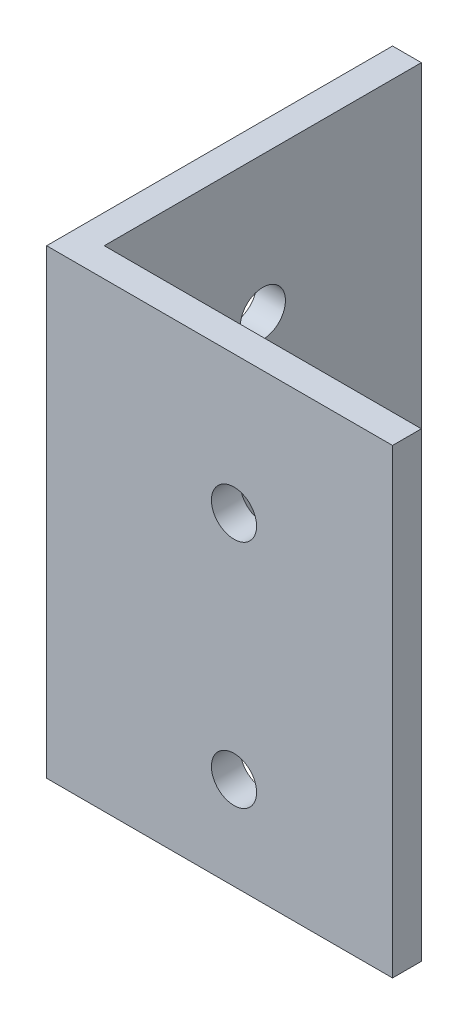
ISO-10303-21;
HEADER;
FILE_DESCRIPTION(('STEP AP214'),'2;1');
FILE_NAME('part.step','',(''),(''),'','','');
FILE_SCHEMA(('AUTOMOTIVE_DESIGN { 1 0 10303 214 1 1 1 1 }'));
ENDSEC;
DATA;
#1=APPLICATION_CONTEXT('core data for automotive mechanical design processes');
#2=APPLICATION_PROTOCOL_DEFINITION('international standard','automotive_design',2000,#1);
#3=PRODUCT_CONTEXT('',#1,'mechanical');
#4=PRODUCT('Part','Part','',(#3));
#5=PRODUCT_RELATED_PRODUCT_CATEGORY('part','',(#4));
#6=PRODUCT_DEFINITION_FORMATION('','',#4);
#7=PRODUCT_DEFINITION_CONTEXT('part definition',#1,'design');
#8=PRODUCT_DEFINITION('design','',#6,#7);
#9=PRODUCT_DEFINITION_SHAPE('','',#8);
#10=(LENGTH_UNIT() NAMED_UNIT(*) SI_UNIT(.MILLI.,.METRE.));
#11=(NAMED_UNIT(*) PLANE_ANGLE_UNIT() SI_UNIT($,.RADIAN.));
#12=(NAMED_UNIT(*) SI_UNIT($,.STERADIAN.) SOLID_ANGLE_UNIT());
#13=UNCERTAINTY_MEASURE_WITH_UNIT(LENGTH_MEASURE(1.E-05),#10,'distance_accuracy_value','');
#14=(GEOMETRIC_REPRESENTATION_CONTEXT(3) GLOBAL_UNCERTAINTY_ASSIGNED_CONTEXT((#13)) GLOBAL_UNIT_ASSIGNED_CONTEXT((#10,
#11,#12)) REPRESENTATION_CONTEXT('',''));
#15=CARTESIAN_POINT('',(0.,0.,0.));
#16=DIRECTION('',(0.,0.,1.));
#17=DIRECTION('',(1.,0.,0.));
#18=AXIS2_PLACEMENT_3D('',#15,#16,#17);
#19=CARTESIAN_POINT('',(0.,25.4,0.));
#20=DIRECTION('',(0.,0.,-1.));
#21=DIRECTION('',(-1.,0.,0.));
#22=AXIS2_PLACEMENT_3D('',#19,#20,#21);
#23=PLANE('',#22);
#24=CARTESIAN_POINT('',(20.6375,10.2108,0.));
#25=DIRECTION('',(0.,0.,-1.));
#26=DIRECTION('',(-1.,0.,0.));
#27=AXIS2_PLACEMENT_3D('',#24,#25,#26);
#28=CIRCLE('',#27,2.4892);
#29=CARTESIAN_POINT('',(18.1483,10.2108,0.));
#30=VERTEX_POINT('',#29);
#31=EDGE_CURVE('E119',#30,#30,#28,.T.);
#32=ORIENTED_EDGE('',*,*,#31,.T.);
#33=EDGE_LOOP('',(#32));
#34=FACE_BOUND('',#33,.T.);
#35=CARTESIAN_POINT('',(20.6375,-15.1892,0.));
#36=DIRECTION('',(0.,0.,-1.));
#37=DIRECTION('',(-1.,0.,0.));
#38=AXIS2_PLACEMENT_3D('',#35,#36,#37);
#39=CIRCLE('',#38,2.4892);
#40=CARTESIAN_POINT('',(18.1483,-15.1892,0.));
#41=VERTEX_POINT('',#40);
#42=EDGE_CURVE('E165',#41,#41,#39,.T.);
#43=ORIENTED_EDGE('',*,*,#42,.T.);
#44=EDGE_LOOP('',(#43));
#45=FACE_BOUND('',#44,.T.);
#46=DIRECTION('',(1.,0.,0.));
#47=VECTOR('',#46,1.);
#48=CARTESIAN_POINT('',(0.,-25.4,0.));
#49=LINE('',#48,#47);
#50=CARTESIAN_POINT('',(0.,-25.4,0.));
#51=VERTEX_POINT('',#50);
#52=CARTESIAN_POINT('',(38.1,-25.4,0.));
#53=VERTEX_POINT('',#52);
#54=EDGE_CURVE('E115',#51,#53,#49,.T.);
#55=ORIENTED_EDGE('',*,*,#54,.T.);
#56=DIRECTION('',(0.,-1.,0.));
#57=VECTOR('',#56,1.);
#58=CARTESIAN_POINT('',(38.1,25.4,0.));
#59=LINE('',#58,#57);
#60=CARTESIAN_POINT('',(38.1,25.4,0.));
#61=VERTEX_POINT('',#60);
#62=EDGE_CURVE('E11',#61,#53,#59,.T.);
#63=ORIENTED_EDGE('',*,*,#62,.F.);
#64=DIRECTION('',(1.,0.,0.));
#65=VECTOR('',#64,1.);
#66=CARTESIAN_POINT('',(0.,25.4,0.));
#67=LINE('',#66,#65);
#68=CARTESIAN_POINT('',(0.,25.4,0.));
#69=VERTEX_POINT('',#68);
#70=EDGE_CURVE('E80',#69,#61,#67,.T.);
#71=ORIENTED_EDGE('',*,*,#70,.F.);
#72=DIRECTION('',(0.,-1.,0.));
#73=VECTOR('',#72,1.);
#74=CARTESIAN_POINT('',(0.,25.4,0.));
#75=LINE('',#74,#73);
#76=EDGE_CURVE('E111',#69,#51,#75,.T.);
#77=ORIENTED_EDGE('',*,*,#76,.T.);
#78=EDGE_LOOP('',(#55,#63,#71,#77));
#79=FACE_BOUND('',#78,.T.);
#80=ADVANCED_FACE('F34',(#34,#45,#79),#23,.F.);
#81=CARTESIAN_POINT('',(38.1,25.4,-3.175));
#82=DIRECTION('',(1.,0.,0.));
#83=DIRECTION('',(0.,0.,-1.));
#84=AXIS2_PLACEMENT_3D('',#81,#82,#83);
#85=PLANE('',#84);
#86=DIRECTION('',(0.,0.,1.));
#87=VECTOR('',#86,1.);
#88=CARTESIAN_POINT('',(38.1,-25.4,-3.175));
#89=LINE('',#88,#87);
#90=CARTESIAN_POINT('',(38.1,-25.4,-3.175));
#91=VERTEX_POINT('',#90);
#92=EDGE_CURVE('E118',#91,#53,#89,.T.);
#93=ORIENTED_EDGE('',*,*,#92,.F.);
#94=DIRECTION('',(0.,-1.,0.));
#95=VECTOR('',#94,1.);
#96=CARTESIAN_POINT('',(38.1,25.4,-3.175));
#97=LINE('',#96,#95);
#98=CARTESIAN_POINT('',(38.1,25.4,-3.175));
#99=VERTEX_POINT('',#98);
#100=EDGE_CURVE('E42',#99,#91,#97,.T.);
#101=ORIENTED_EDGE('',*,*,#100,.F.);
#102=DIRECTION('',(0.,0.,1.));
#103=VECTOR('',#102,1.);
#104=CARTESIAN_POINT('',(38.1,25.4,-3.175));
#105=LINE('',#104,#103);
#106=EDGE_CURVE('E178',#99,#61,#105,.T.);
#107=ORIENTED_EDGE('',*,*,#106,.T.);
#108=ORIENTED_EDGE('',*,*,#62,.T.);
#109=EDGE_LOOP('',(#93,#101,#107,#108));
#110=FACE_BOUND('',#109,.T.);
#111=ADVANCED_FACE('F137',(#110),#85,.T.);
#112=CARTESIAN_POINT('',(0.,25.4,-3.175));
#113=DIRECTION('',(0.,0.,-1.));
#114=DIRECTION('',(-1.,0.,0.));
#115=AXIS2_PLACEMENT_3D('',#112,#113,#114);
#116=PLANE('',#115);
#117=CARTESIAN_POINT('',(20.6375,10.2108,-3.175));
#118=DIRECTION('',(0.,0.,-1.));
#119=DIRECTION('',(-1.,0.,0.));
#120=AXIS2_PLACEMENT_3D('',#117,#118,#119);
#121=CIRCLE('',#120,2.4892);
#122=CARTESIAN_POINT('',(18.1483,10.2108,-3.175));
#123=VERTEX_POINT('',#122);
#124=EDGE_CURVE('E167',#123,#123,#121,.T.);
#125=ORIENTED_EDGE('',*,*,#124,.F.);
#126=EDGE_LOOP('',(#125));
#127=FACE_BOUND('',#126,.T.);
#128=CARTESIAN_POINT('',(20.6375,-15.1892,-3.175));
#129=DIRECTION('',(0.,0.,-1.));
#130=DIRECTION('',(-1.,0.,0.));
#131=AXIS2_PLACEMENT_3D('',#128,#129,#130);
#132=CIRCLE('',#131,2.4892);
#133=CARTESIAN_POINT('',(18.1483,-15.1892,-3.175));
#134=VERTEX_POINT('',#133);
#135=EDGE_CURVE('E168',#134,#134,#132,.T.);
#136=ORIENTED_EDGE('',*,*,#135,.F.);
#137=EDGE_LOOP('',(#136));
#138=FACE_BOUND('',#137,.T.);
#139=DIRECTION('',(1.,0.,0.));
#140=VECTOR('',#139,1.);
#141=CARTESIAN_POINT('',(0.,-25.4,-3.175));
#142=LINE('',#141,#140);
#143=CARTESIAN_POINT('',(3.175,-25.4,-3.175));
#144=VERTEX_POINT('',#143);
#145=EDGE_CURVE('E122',#144,#91,#142,.T.);
#146=ORIENTED_EDGE('',*,*,#145,.F.);
#147=DIRECTION('',(0.,-1.,0.));
#148=VECTOR('',#147,1.);
#149=CARTESIAN_POINT('',(3.175,25.4,-3.175));
#150=LINE('',#149,#148);
#151=CARTESIAN_POINT('',(3.175,25.4,-3.175));
#152=VERTEX_POINT('',#151);
#153=EDGE_CURVE('E101',#152,#144,#150,.T.);
#154=ORIENTED_EDGE('',*,*,#153,.F.);
#155=DIRECTION('',(1.,0.,0.));
#156=VECTOR('',#155,1.);
#157=CARTESIAN_POINT('',(0.,25.4,-3.175));
#158=LINE('',#157,#156);
#159=EDGE_CURVE('E107',#152,#99,#158,.T.);
#160=ORIENTED_EDGE('',*,*,#159,.T.);
#161=ORIENTED_EDGE('',*,*,#100,.T.);
#162=EDGE_LOOP('',(#146,#154,#160,#161));
#163=FACE_BOUND('',#162,.T.);
#164=ADVANCED_FACE('F134',(#127,#138,#163),#116,.T.);
#165=CARTESIAN_POINT('',(3.175,25.4,-38.1));
#166=DIRECTION('',(1.,0.,0.));
#167=DIRECTION('',(0.,0.,-1.));
#168=AXIS2_PLACEMENT_3D('',#165,#166,#167);
#169=PLANE('',#168);
#170=CARTESIAN_POINT('',(3.175,10.2108,-20.6375));
#171=DIRECTION('',(-1.,0.,0.));
#172=DIRECTION('',(0.,0.,1.));
#173=AXIS2_PLACEMENT_3D('',#170,#171,#172);
#174=CIRCLE('',#173,2.4892);
#175=CARTESIAN_POINT('',(3.175,10.2108,-18.1483));
#176=VERTEX_POINT('',#175);
#177=EDGE_CURVE('E186',#176,#176,#174,.T.);
#178=ORIENTED_EDGE('',*,*,#177,.T.);
#179=EDGE_LOOP('',(#178));
#180=FACE_BOUND('',#179,.T.);
#181=CARTESIAN_POINT('',(3.175,-15.1892,-20.6375));
#182=DIRECTION('',(-1.,0.,0.));
#183=DIRECTION('',(0.,0.,1.));
#184=AXIS2_PLACEMENT_3D('',#181,#182,#183);
#185=CIRCLE('',#184,2.4892);
#186=CARTESIAN_POINT('',(3.175,-15.1892,-18.1483));
#187=VERTEX_POINT('',#186);
#188=EDGE_CURVE('E180',#187,#187,#185,.T.);
#189=ORIENTED_EDGE('',*,*,#188,.T.);
#190=EDGE_LOOP('',(#189));
#191=FACE_BOUND('',#190,.T.);
#192=DIRECTION('',(0.,0.,-1.));
#193=VECTOR('',#192,1.);
#194=CARTESIAN_POINT('',(3.175,-25.4,-38.1));
#195=LINE('',#194,#193);
#196=CARTESIAN_POINT('',(3.175,-25.4,-38.1));
#197=VERTEX_POINT('',#196);
#198=EDGE_CURVE('E96',#197,#144,#195,.F.);
#199=ORIENTED_EDGE('',*,*,#198,.F.);
#200=DIRECTION('',(0.,-1.,0.));
#201=VECTOR('',#200,1.);
#202=CARTESIAN_POINT('',(3.175,25.4,-38.1));
#203=LINE('',#202,#201);
#204=CARTESIAN_POINT('',(3.175,25.4,-38.1));
#205=VERTEX_POINT('',#204);
#206=EDGE_CURVE('E91',#205,#197,#203,.T.);
#207=ORIENTED_EDGE('',*,*,#206,.F.);
#208=DIRECTION('',(0.,0.,-1.));
#209=VECTOR('',#208,1.);
#210=CARTESIAN_POINT('',(3.175,25.4,-38.1));
#211=LINE('',#210,#209);
#212=EDGE_CURVE('E94',#205,#152,#211,.F.);
#213=ORIENTED_EDGE('',*,*,#212,.T.);
#214=ORIENTED_EDGE('',*,*,#153,.T.);
#215=EDGE_LOOP('',(#199,#207,#213,#214));
#216=FACE_BOUND('',#215,.T.);
#217=ADVANCED_FACE('F93',(#180,#191,#216),#169,.T.);
#218=CARTESIAN_POINT('',(0.,25.4,-38.1));
#219=DIRECTION('',(0.,0.,-1.));
#220=DIRECTION('',(-1.,0.,0.));
#221=AXIS2_PLACEMENT_3D('',#218,#219,#220);
#222=PLANE('',#221);
#223=DIRECTION('',(1.,0.,0.));
#224=VECTOR('',#223,1.);
#225=CARTESIAN_POINT('',(0.,-25.4,-38.1));
#226=LINE('',#225,#224);
#227=CARTESIAN_POINT('',(0.,-25.4,-38.1));
#228=VERTEX_POINT('',#227);
#229=EDGE_CURVE('E126',#228,#197,#226,.T.);
#230=ORIENTED_EDGE('',*,*,#229,.F.);
#231=DIRECTION('',(0.,-1.,0.));
#232=VECTOR('',#231,1.);
#233=CARTESIAN_POINT('',(0.,25.4,-38.1));
#234=LINE('',#233,#232);
#235=CARTESIAN_POINT('',(0.,25.4,-38.1));
#236=VERTEX_POINT('',#235);
#237=EDGE_CURVE('E71',#236,#228,#234,.T.);
#238=ORIENTED_EDGE('',*,*,#237,.F.);
#239=DIRECTION('',(1.,0.,0.));
#240=VECTOR('',#239,1.);
#241=CARTESIAN_POINT('',(0.,25.4,-38.1));
#242=LINE('',#241,#240);
#243=EDGE_CURVE('E105',#236,#205,#242,.T.);
#244=ORIENTED_EDGE('',*,*,#243,.T.);
#245=ORIENTED_EDGE('',*,*,#206,.T.);
#246=EDGE_LOOP('',(#230,#238,#244,#245));
#247=FACE_BOUND('',#246,.T.);
#248=ADVANCED_FACE('F109',(#247),#222,.T.);
#249=CARTESIAN_POINT('',(0.,25.4,-38.1));
#250=DIRECTION('',(1.,0.,0.));
#251=DIRECTION('',(0.,0.,-1.));
#252=AXIS2_PLACEMENT_3D('',#249,#250,#251);
#253=PLANE('',#252);
#254=CARTESIAN_POINT('',(0.,10.2108,-20.6375));
#255=DIRECTION('',(-1.,0.,0.));
#256=DIRECTION('',(0.,0.,1.));
#257=AXIS2_PLACEMENT_3D('',#254,#255,#256);
#258=CIRCLE('',#257,2.4892);
#259=CARTESIAN_POINT('',(0.,10.2108,-18.1483));
#260=VERTEX_POINT('',#259);
#261=EDGE_CURVE('E173',#260,#260,#258,.T.);
#262=ORIENTED_EDGE('',*,*,#261,.F.);
#263=EDGE_LOOP('',(#262));
#264=FACE_BOUND('',#263,.T.);
#265=CARTESIAN_POINT('',(0.,-15.1892,-20.6375));
#266=DIRECTION('',(-1.,0.,0.));
#267=DIRECTION('',(0.,0.,1.));
#268=AXIS2_PLACEMENT_3D('',#265,#266,#267);
#269=CIRCLE('',#268,2.4892);
#270=CARTESIAN_POINT('',(0.,-15.1892,-18.1483));
#271=VERTEX_POINT('',#270);
#272=EDGE_CURVE('E183',#271,#271,#269,.T.);
#273=ORIENTED_EDGE('',*,*,#272,.F.);
#274=EDGE_LOOP('',(#273));
#275=FACE_BOUND('',#274,.T.);
#276=DIRECTION('',(0.,0.,1.));
#277=VECTOR('',#276,1.);
#278=CARTESIAN_POINT('',(0.,-25.4,-38.1));
#279=LINE('',#278,#277);
#280=EDGE_CURVE('E74',#228,#51,#279,.T.);
#281=ORIENTED_EDGE('',*,*,#280,.T.);
#282=ORIENTED_EDGE('',*,*,#76,.F.);
#283=DIRECTION('',(0.,0.,1.));
#284=VECTOR('',#283,1.);
#285=CARTESIAN_POINT('',(0.,25.4,-38.1));
#286=LINE('',#285,#284);
#287=EDGE_CURVE('E50',#236,#69,#286,.T.);
#288=ORIENTED_EDGE('',*,*,#287,.F.);
#289=ORIENTED_EDGE('',*,*,#237,.T.);
#290=EDGE_LOOP('',(#281,#282,#288,#289));
#291=FACE_BOUND('',#290,.T.);
#292=ADVANCED_FACE('F142',(#264,#275,#291),#253,.F.);
#293=CARTESIAN_POINT('',(0.,25.4,0.));
#294=DIRECTION('',(0.,-1.,0.));
#295=DIRECTION('',(-1.,0.,0.));
#296=AXIS2_PLACEMENT_3D('',#293,#294,#295);
#297=PLANE('',#296);
#298=ORIENTED_EDGE('',*,*,#70,.T.);
#299=ORIENTED_EDGE('',*,*,#106,.F.);
#300=ORIENTED_EDGE('',*,*,#159,.F.);
#301=ORIENTED_EDGE('',*,*,#212,.F.);
#302=ORIENTED_EDGE('',*,*,#243,.F.);
#303=ORIENTED_EDGE('',*,*,#287,.T.);
#304=EDGE_LOOP('',(#298,#299,#300,#301,#302,#303));
#305=FACE_BOUND('',#304,.T.);
#306=ADVANCED_FACE('F104',(#305),#297,.F.);
#307=CARTESIAN_POINT('',(0.,-25.4,0.));
#308=DIRECTION('',(0.,-1.,0.));
#309=DIRECTION('',(-1.,0.,0.));
#310=AXIS2_PLACEMENT_3D('',#307,#308,#309);
#311=PLANE('',#310);
#312=ORIENTED_EDGE('',*,*,#54,.F.);
#313=ORIENTED_EDGE('',*,*,#280,.F.);
#314=ORIENTED_EDGE('',*,*,#229,.T.);
#315=ORIENTED_EDGE('',*,*,#198,.T.);
#316=ORIENTED_EDGE('',*,*,#145,.T.);
#317=ORIENTED_EDGE('',*,*,#92,.T.);
#318=EDGE_LOOP('',(#312,#313,#314,#315,#316,#317));
#319=FACE_BOUND('',#318,.T.);
#320=ADVANCED_FACE('F140',(#319),#311,.T.);
#321=CARTESIAN_POINT('',(20.6375,-15.1892,0.));
#322=DIRECTION('',(0.,0.,-1.));
#323=DIRECTION('',(-1.,0.,0.));
#324=AXIS2_PLACEMENT_3D('',#321,#322,#323);
#325=CYLINDRICAL_SURFACE('',#324,2.4892);
#326=ORIENTED_EDGE('',*,*,#42,.F.);
#327=EDGE_LOOP('',(#326));
#328=FACE_BOUND('',#327,.T.);
#329=ORIENTED_EDGE('',*,*,#135,.T.);
#330=EDGE_LOOP('',(#329));
#331=FACE_BOUND('',#330,.T.);
#332=ADVANCED_FACE('F210',(#328,#331),#325,.F.);
#333=CARTESIAN_POINT('',(20.6375,10.2108,0.));
#334=DIRECTION('',(0.,0.,-1.));
#335=DIRECTION('',(-1.,0.,0.));
#336=AXIS2_PLACEMENT_3D('',#333,#334,#335);
#337=CYLINDRICAL_SURFACE('',#336,2.4892);
#338=ORIENTED_EDGE('',*,*,#31,.F.);
#339=EDGE_LOOP('',(#338));
#340=FACE_BOUND('',#339,.T.);
#341=ORIENTED_EDGE('',*,*,#124,.T.);
#342=EDGE_LOOP('',(#341));
#343=FACE_BOUND('',#342,.T.);
#344=ADVANCED_FACE('F204',(#340,#343),#337,.F.);
#345=CARTESIAN_POINT('',(0.,-15.1892,-20.6375));
#346=DIRECTION('',(1.,0.,0.));
#347=DIRECTION('',(0.,0.,-1.));
#348=AXIS2_PLACEMENT_3D('',#345,#346,#347);
#349=CYLINDRICAL_SURFACE('',#348,2.4892);
#350=ORIENTED_EDGE('',*,*,#272,.T.);
#351=EDGE_LOOP('',(#350));
#352=FACE_BOUND('',#351,.T.);
#353=ORIENTED_EDGE('',*,*,#188,.F.);
#354=EDGE_LOOP('',(#353));
#355=FACE_BOUND('',#354,.T.);
#356=ADVANCED_FACE('F194',(#352,#355),#349,.F.);
#357=CARTESIAN_POINT('',(0.,10.2108,-20.6375));
#358=DIRECTION('',(1.,0.,0.));
#359=DIRECTION('',(0.,0.,-1.));
#360=AXIS2_PLACEMENT_3D('',#357,#358,#359);
#361=CYLINDRICAL_SURFACE('',#360,2.4892);
#362=ORIENTED_EDGE('',*,*,#261,.T.);
#363=EDGE_LOOP('',(#362));
#364=FACE_BOUND('',#363,.T.);
#365=ORIENTED_EDGE('',*,*,#177,.F.);
#366=EDGE_LOOP('',(#365));
#367=FACE_BOUND('',#366,.T.);
#368=ADVANCED_FACE('F191',(#364,#367),#361,.F.);
#369=CLOSED_SHELL('',(#80,#111,#164,#217,#248,#292,#306,#320,#332,#344,#356,#368));
#370=MANIFOLD_SOLID_BREP('B2',#369);
#371=ADVANCED_BREP_SHAPE_REPRESENTATION('',(#18,#370),#14);
#372=SHAPE_DEFINITION_REPRESENTATION(#9,#371);
ENDSEC;
END-ISO-10303-21;
